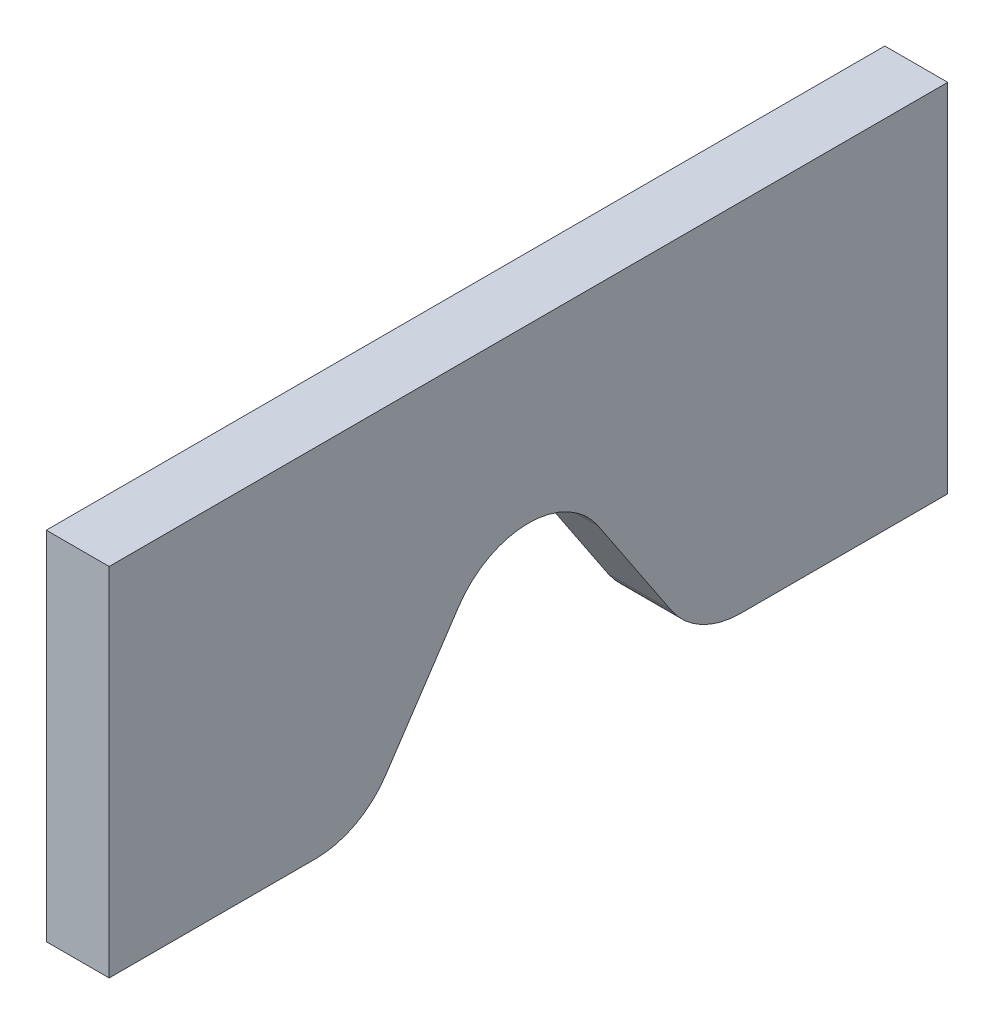
ISO-10303-21;
HEADER;
FILE_DESCRIPTION(('STEP AP214'),'2;1');
FILE_NAME('part.step','',(''),(''),'','','');
FILE_SCHEMA(('AUTOMOTIVE_DESIGN { 1 0 10303 214 1 1 1 1 }'));
ENDSEC;
DATA;
#1=APPLICATION_CONTEXT('core data for automotive mechanical design processes');
#2=APPLICATION_PROTOCOL_DEFINITION('international standard','automotive_design',2000,#1);
#3=PRODUCT_CONTEXT('',#1,'mechanical');
#4=PRODUCT('Part','Part','',(#3));
#5=PRODUCT_RELATED_PRODUCT_CATEGORY('part','',(#4));
#6=PRODUCT_DEFINITION_FORMATION('','',#4);
#7=PRODUCT_DEFINITION_CONTEXT('part definition',#1,'design');
#8=PRODUCT_DEFINITION('design','',#6,#7);
#9=PRODUCT_DEFINITION_SHAPE('','',#8);
#10=(LENGTH_UNIT() NAMED_UNIT(*) SI_UNIT(.MILLI.,.METRE.));
#11=(NAMED_UNIT(*) PLANE_ANGLE_UNIT() SI_UNIT($,.RADIAN.));
#12=(NAMED_UNIT(*) SI_UNIT($,.STERADIAN.) SOLID_ANGLE_UNIT());
#13=UNCERTAINTY_MEASURE_WITH_UNIT(LENGTH_MEASURE(1.E-05),#10,'distance_accuracy_value','');
#14=(GEOMETRIC_REPRESENTATION_CONTEXT(3) GLOBAL_UNCERTAINTY_ASSIGNED_CONTEXT((#13)) GLOBAL_UNIT_ASSIGNED_CONTEXT((#10,
#11,#12)) REPRESENTATION_CONTEXT('',''));
#15=CARTESIAN_POINT('',(0.,0.,0.));
#16=DIRECTION('',(0.,0.,1.));
#17=DIRECTION('',(1.,0.,0.));
#18=AXIS2_PLACEMENT_3D('',#15,#16,#17);
#19=CARTESIAN_POINT('',(19.05,0.,64.3936674655951));
#20=DIRECTION('',(0.,1.,0.));
#21=DIRECTION('',(0.,0.,1.));
#22=AXIS2_PLACEMENT_3D('',#19,#20,#21);
#23=PLANE('',#22);
#24=DIRECTION('',(0.,0.,-1.));
#25=VECTOR('',#24,1.);
#26=CARTESIAN_POINT('',(0.,0.,64.3936674655951));
#27=LINE('',#26,#25);
#28=CARTESIAN_POINT('',(0.,0.,127.));
#29=VERTEX_POINT('',#28);
#30=CARTESIAN_POINT('',(0.,0.,64.3936674655951));
#31=VERTEX_POINT('',#30);
#32=EDGE_CURVE('E141',#29,#31,#27,.T.);
#33=ORIENTED_EDGE('',*,*,#32,.T.);
#34=DIRECTION('',(-1.,0.,0.));
#35=VECTOR('',#34,1.);
#36=CARTESIAN_POINT('',(19.05,0.,64.3936674655951));
#37=LINE('',#36,#35);
#38=CARTESIAN_POINT('',(19.05,0.,64.3936674655951));
#39=VERTEX_POINT('',#38);
#40=EDGE_CURVE('E11',#39,#31,#37,.T.);
#41=ORIENTED_EDGE('',*,*,#40,.F.);
#42=DIRECTION('',(0.,0.,-1.));
#43=VECTOR('',#42,1.);
#44=CARTESIAN_POINT('',(19.05,0.,64.3936674655951));
#45=LINE('',#44,#43);
#46=CARTESIAN_POINT('',(19.05,0.,127.));
#47=VERTEX_POINT('',#46);
#48=EDGE_CURVE('E159',#47,#39,#45,.T.);
#49=ORIENTED_EDGE('',*,*,#48,.F.);
#50=DIRECTION('',(-1.,0.,0.));
#51=VECTOR('',#50,1.);
#52=CARTESIAN_POINT('',(19.05,0.,127.));
#53=LINE('',#52,#51);
#54=EDGE_CURVE('E137',#47,#29,#53,.T.);
#55=ORIENTED_EDGE('',*,*,#54,.T.);
#56=EDGE_LOOP('',(#33,#41,#49,#55));
#57=FACE_BOUND('',#56,.T.);
#58=ADVANCED_FACE('F33',(#57),#23,.F.);
#59=CARTESIAN_POINT('',(19.05,25.4,64.3936674655951));
#60=DIRECTION('',(-1.,0.,0.));
#61=DIRECTION('',(0.,0.,1.));
#62=AXIS2_PLACEMENT_3D('',#59,#60,#61);
#63=CYLINDRICAL_SURFACE('',#62,25.4);
#64=CARTESIAN_POINT('',(0.,25.4,64.3936674655951));
#65=DIRECTION('',(1.,0.,0.));
#66=DIRECTION('',(0.,0.,1.));
#67=AXIS2_PLACEMENT_3D('',#64,#65,#66);
#68=CIRCLE('',#67,25.4);
#69=CARTESIAN_POINT('',(0.,11.3106150158792,43.2595899894139));
#70=VERTEX_POINT('',#69);
#71=EDGE_CURVE('E144',#31,#70,#68,.T.);
#72=ORIENTED_EDGE('',*,*,#71,.T.);
#73=DIRECTION('',(-1.,0.,0.));
#74=VECTOR('',#73,1.);
#75=CARTESIAN_POINT('',(19.05,11.3106150158792,43.2595899894139));
#76=LINE('',#75,#74);
#77=CARTESIAN_POINT('',(19.05,11.3106150158792,43.2595899894139));
#78=VERTEX_POINT('',#77);
#79=EDGE_CURVE('E41',#78,#70,#76,.T.);
#80=ORIENTED_EDGE('',*,*,#79,.F.);
#81=CARTESIAN_POINT('',(19.05,25.4,64.3936674655951));
#82=DIRECTION('',(1.,0.,0.));
#83=DIRECTION('',(0.,0.,1.));
#84=AXIS2_PLACEMENT_3D('',#81,#82,#83);
#85=CIRCLE('',#84,25.4);
#86=EDGE_CURVE('E98',#39,#78,#85,.T.);
#87=ORIENTED_EDGE('',*,*,#86,.F.);
#88=ORIENTED_EDGE('',*,*,#40,.T.);
#89=EDGE_LOOP('',(#72,#80,#87,#88));
#90=FACE_BOUND('',#89,.T.);
#91=ADVANCED_FACE('F208',(#90),#63,.T.);
#92=CARTESIAN_POINT('',(19.05,44.4988837857281,21.1340774761812));
#93=DIRECTION('',(0.,0.554700196225229,0.832050294337844));
#94=DIRECTION('',(0.,-0.832050294337844,0.554700196225229));
#95=AXIS2_PLACEMENT_3D('',#92,#93,#94);
#96=PLANE('',#95);
#97=DIRECTION('',(0.,0.832050294337844,-0.554700196225229));
#98=VECTOR('',#97,1.);
#99=CARTESIAN_POINT('',(0.,44.4988837857281,21.1340774761812));
#100=LINE('',#99,#98);
#101=CARTESIAN_POINT('',(0.,44.4988837857281,21.1340774761812));
#102=VERTEX_POINT('',#101);
#103=EDGE_CURVE('E146',#70,#102,#100,.T.);
#104=ORIENTED_EDGE('',*,*,#103,.T.);
#105=DIRECTION('',(-1.,0.,0.));
#106=VECTOR('',#105,1.);
#107=CARTESIAN_POINT('',(19.05,44.4988837857281,21.1340774761812));
#108=LINE('',#107,#106);
#109=CARTESIAN_POINT('',(19.05,44.4988837857281,21.1340774761812));
#110=VERTEX_POINT('',#109);
#111=EDGE_CURVE('E172',#110,#102,#108,.T.);
#112=ORIENTED_EDGE('',*,*,#111,.F.);
#113=DIRECTION('',(0.,0.832050294337844,-0.554700196225229));
#114=VECTOR('',#113,1.);
#115=CARTESIAN_POINT('',(19.05,44.4988837857281,21.1340774761812));
#116=LINE('',#115,#114);
#117=EDGE_CURVE('E180',#78,#110,#116,.T.);
#118=ORIENTED_EDGE('',*,*,#117,.F.);
#119=ORIENTED_EDGE('',*,*,#79,.T.);
#120=EDGE_LOOP('',(#104,#112,#118,#119));
#121=FACE_BOUND('',#120,.T.);
#122=ADVANCED_FACE('F178',(#121),#96,.F.);
#123=CARTESIAN_POINT('',(19.05,30.4094988016073,0.));
#124=DIRECTION('',(-1.,0.,0.));
#125=DIRECTION('',(0.,0.,1.));
#126=AXIS2_PLACEMENT_3D('',#123,#124,#125);
#127=CYLINDRICAL_SURFACE('',#126,25.4);
#128=CARTESIAN_POINT('',(0.,30.4094988016073,0.));
#129=DIRECTION('',(-1.,0.,0.));
#130=DIRECTION('',(0.,0.,-1.));
#131=AXIS2_PLACEMENT_3D('',#128,#129,#130);
#132=CIRCLE('',#131,25.4);
#133=CARTESIAN_POINT('',(0.,44.4988837857281,-21.1340774761812));
#134=VERTEX_POINT('',#133);
#135=EDGE_CURVE('E148',#102,#134,#132,.T.);
#136=ORIENTED_EDGE('',*,*,#135,.T.);
#137=DIRECTION('',(-1.,0.,0.));
#138=VECTOR('',#137,1.);
#139=CARTESIAN_POINT('',(19.05,44.4988837857281,-21.1340774761812));
#140=LINE('',#139,#138);
#141=CARTESIAN_POINT('',(19.05,44.4988837857281,-21.1340774761812));
#142=VERTEX_POINT('',#141);
#143=EDGE_CURVE('E169',#142,#134,#140,.T.);
#144=ORIENTED_EDGE('',*,*,#143,.F.);
#145=CARTESIAN_POINT('',(19.05,30.4094988016073,0.));
#146=DIRECTION('',(-1.,0.,0.));
#147=DIRECTION('',(0.,0.,-1.));
#148=AXIS2_PLACEMENT_3D('',#145,#146,#147);
#149=CIRCLE('',#148,25.4);
#150=EDGE_CURVE('E198',#110,#142,#149,.T.);
#151=ORIENTED_EDGE('',*,*,#150,.F.);
#152=ORIENTED_EDGE('',*,*,#111,.T.);
#153=EDGE_LOOP('',(#136,#144,#151,#152));
#154=FACE_BOUND('',#153,.T.);
#155=ADVANCED_FACE('F189',(#154),#127,.F.);
#156=CARTESIAN_POINT('',(19.05,11.3106150158792,-43.2595899894139));
#157=DIRECTION('',(0.,0.554700196225229,-0.832050294337844));
#158=DIRECTION('',(0.,0.832050294337844,0.554700196225229));
#159=AXIS2_PLACEMENT_3D('',#156,#157,#158);
#160=PLANE('',#159);
#161=DIRECTION('',(0.,-0.832050294337844,-0.554700196225229));
#162=VECTOR('',#161,1.);
#163=CARTESIAN_POINT('',(0.,11.3106150158792,-43.2595899894139));
#164=LINE('',#163,#162);
#165=CARTESIAN_POINT('',(0.,11.3106150158792,-43.2595899894139));
#166=VERTEX_POINT('',#165);
#167=EDGE_CURVE('E150',#134,#166,#164,.T.);
#168=ORIENTED_EDGE('',*,*,#167,.T.);
#169=DIRECTION('',(-1.,0.,0.));
#170=VECTOR('',#169,1.);
#171=CARTESIAN_POINT('',(19.05,11.3106150158792,-43.2595899894139));
#172=LINE('',#171,#170);
#173=CARTESIAN_POINT('',(19.05,11.3106150158792,-43.2595899894139));
#174=VERTEX_POINT('',#173);
#175=EDGE_CURVE('E166',#174,#166,#172,.T.);
#176=ORIENTED_EDGE('',*,*,#175,.F.);
#177=DIRECTION('',(0.,-0.832050294337844,-0.554700196225229));
#178=VECTOR('',#177,1.);
#179=CARTESIAN_POINT('',(19.05,11.3106150158792,-43.2595899894139));
#180=LINE('',#179,#178);
#181=EDGE_CURVE('E195',#142,#174,#180,.T.);
#182=ORIENTED_EDGE('',*,*,#181,.F.);
#183=ORIENTED_EDGE('',*,*,#143,.T.);
#184=EDGE_LOOP('',(#168,#176,#182,#183));
#185=FACE_BOUND('',#184,.T.);
#186=ADVANCED_FACE('F193',(#185),#160,.F.);
#187=CARTESIAN_POINT('',(19.05,25.4,-64.3936674655951));
#188=DIRECTION('',(-1.,0.,0.));
#189=DIRECTION('',(0.,0.,1.));
#190=AXIS2_PLACEMENT_3D('',#187,#188,#189);
#191=CYLINDRICAL_SURFACE('',#190,25.4);
#192=CARTESIAN_POINT('',(0.,25.4,-64.3936674655951));
#193=DIRECTION('',(1.,0.,0.));
#194=DIRECTION('',(0.,0.,1.));
#195=AXIS2_PLACEMENT_3D('',#192,#193,#194);
#196=CIRCLE('',#195,25.4);
#197=CARTESIAN_POINT('',(0.,0.,-64.3936674655951));
#198=VERTEX_POINT('',#197);
#199=EDGE_CURVE('E152',#166,#198,#196,.T.);
#200=ORIENTED_EDGE('',*,*,#199,.T.);
#201=DIRECTION('',(-1.,0.,0.));
#202=VECTOR('',#201,1.);
#203=CARTESIAN_POINT('',(19.05,0.,-64.3936674655951));
#204=LINE('',#203,#202);
#205=CARTESIAN_POINT('',(19.05,0.,-64.3936674655951));
#206=VERTEX_POINT('',#205);
#207=EDGE_CURVE('E163',#206,#198,#204,.T.);
#208=ORIENTED_EDGE('',*,*,#207,.F.);
#209=CARTESIAN_POINT('',(19.05,25.4,-64.3936674655951));
#210=DIRECTION('',(1.,0.,0.));
#211=DIRECTION('',(0.,0.,1.));
#212=AXIS2_PLACEMENT_3D('',#209,#210,#211);
#213=CIRCLE('',#212,25.4);
#214=EDGE_CURVE('E197',#174,#206,#213,.T.);
#215=ORIENTED_EDGE('',*,*,#214,.F.);
#216=ORIENTED_EDGE('',*,*,#175,.T.);
#217=EDGE_LOOP('',(#200,#208,#215,#216));
#218=FACE_BOUND('',#217,.T.);
#219=ADVANCED_FACE('F220',(#218),#191,.T.);
#220=CARTESIAN_POINT('',(19.05,0.,-127.));
#221=DIRECTION('',(0.,1.,0.));
#222=DIRECTION('',(0.,0.,1.));
#223=AXIS2_PLACEMENT_3D('',#220,#221,#222);
#224=PLANE('',#223);
#225=DIRECTION('',(0.,0.,-1.));
#226=VECTOR('',#225,1.);
#227=CARTESIAN_POINT('',(0.,0.,-127.));
#228=LINE('',#227,#226);
#229=CARTESIAN_POINT('',(0.,0.,-127.));
#230=VERTEX_POINT('',#229);
#231=EDGE_CURVE('E154',#198,#230,#228,.T.);
#232=ORIENTED_EDGE('',*,*,#231,.T.);
#233=DIRECTION('',(-1.,0.,0.));
#234=VECTOR('',#233,1.);
#235=CARTESIAN_POINT('',(19.05,0.,-127.));
#236=LINE('',#235,#234);
#237=CARTESIAN_POINT('',(19.05,0.,-127.));
#238=VERTEX_POINT('',#237);
#239=EDGE_CURVE('E132',#238,#230,#236,.T.);
#240=ORIENTED_EDGE('',*,*,#239,.F.);
#241=DIRECTION('',(0.,0.,-1.));
#242=VECTOR('',#241,1.);
#243=CARTESIAN_POINT('',(19.05,0.,-127.));
#244=LINE('',#243,#242);
#245=EDGE_CURVE('E123',#206,#238,#244,.T.);
#246=ORIENTED_EDGE('',*,*,#245,.F.);
#247=ORIENTED_EDGE('',*,*,#207,.T.);
#248=EDGE_LOOP('',(#232,#240,#246,#247));
#249=FACE_BOUND('',#248,.T.);
#250=ADVANCED_FACE('F223',(#249),#224,.F.);
#251=CARTESIAN_POINT('',(19.05,107.95,-127.));
#252=DIRECTION('',(0.,0.,1.));
#253=DIRECTION('',(1.,0.,0.));
#254=AXIS2_PLACEMENT_3D('',#251,#252,#253);
#255=PLANE('',#254);
#256=DIRECTION('',(0.,1.,0.));
#257=VECTOR('',#256,1.);
#258=CARTESIAN_POINT('',(0.,107.95,-127.));
#259=LINE('',#258,#257);
#260=CARTESIAN_POINT('',(0.,107.95,-127.));
#261=VERTEX_POINT('',#260);
#262=EDGE_CURVE('E131',#230,#261,#259,.T.);
#263=ORIENTED_EDGE('',*,*,#262,.T.);
#264=DIRECTION('',(-1.,0.,0.));
#265=VECTOR('',#264,1.);
#266=CARTESIAN_POINT('',(19.05,107.95,-127.));
#267=LINE('',#266,#265);
#268=CARTESIAN_POINT('',(19.05,107.95,-127.));
#269=VERTEX_POINT('',#268);
#270=EDGE_CURVE('E128',#269,#261,#267,.T.);
#271=ORIENTED_EDGE('',*,*,#270,.F.);
#272=DIRECTION('',(0.,1.,0.));
#273=VECTOR('',#272,1.);
#274=CARTESIAN_POINT('',(19.05,107.95,-127.));
#275=LINE('',#274,#273);
#276=EDGE_CURVE('E117',#238,#269,#275,.T.);
#277=ORIENTED_EDGE('',*,*,#276,.F.);
#278=ORIENTED_EDGE('',*,*,#239,.T.);
#279=EDGE_LOOP('',(#263,#271,#277,#278));
#280=FACE_BOUND('',#279,.T.);
#281=ADVANCED_FACE('F129',(#280),#255,.F.);
#282=CARTESIAN_POINT('',(19.05,107.95,127.));
#283=DIRECTION('',(0.,-1.,0.));
#284=DIRECTION('',(0.,0.,-1.));
#285=AXIS2_PLACEMENT_3D('',#282,#283,#284);
#286=PLANE('',#285);
#287=DIRECTION('',(0.,0.,1.));
#288=VECTOR('',#287,1.);
#289=CARTESIAN_POINT('',(0.,107.95,127.));
#290=LINE('',#289,#288);
#291=CARTESIAN_POINT('',(0.,107.95,127.));
#292=VERTEX_POINT('',#291);
#293=EDGE_CURVE('E84',#261,#292,#290,.T.);
#294=ORIENTED_EDGE('',*,*,#293,.T.);
#295=DIRECTION('',(-1.,0.,0.));
#296=VECTOR('',#295,1.);
#297=CARTESIAN_POINT('',(19.05,107.95,127.));
#298=LINE('',#297,#296);
#299=CARTESIAN_POINT('',(19.05,107.95,127.));
#300=VERTEX_POINT('',#299);
#301=EDGE_CURVE('E133',#300,#292,#298,.T.);
#302=ORIENTED_EDGE('',*,*,#301,.F.);
#303=DIRECTION('',(0.,0.,1.));
#304=VECTOR('',#303,1.);
#305=CARTESIAN_POINT('',(19.05,107.95,127.));
#306=LINE('',#305,#304);
#307=EDGE_CURVE('E121',#269,#300,#306,.T.);
#308=ORIENTED_EDGE('',*,*,#307,.F.);
#309=ORIENTED_EDGE('',*,*,#270,.T.);
#310=EDGE_LOOP('',(#294,#302,#308,#309));
#311=FACE_BOUND('',#310,.T.);
#312=ADVANCED_FACE('F135',(#311),#286,.F.);
#313=CARTESIAN_POINT('',(19.05,0.,127.));
#314=DIRECTION('',(0.,0.,-1.));
#315=DIRECTION('',(-1.,0.,0.));
#316=AXIS2_PLACEMENT_3D('',#313,#314,#315);
#317=PLANE('',#316);
#318=DIRECTION('',(0.,-1.,0.));
#319=VECTOR('',#318,1.);
#320=CARTESIAN_POINT('',(0.,0.,127.));
#321=LINE('',#320,#319);
#322=EDGE_CURVE('E90',#292,#29,#321,.T.);
#323=ORIENTED_EDGE('',*,*,#322,.T.);
#324=ORIENTED_EDGE('',*,*,#54,.F.);
#325=DIRECTION('',(0.,-1.,0.));
#326=VECTOR('',#325,1.);
#327=CARTESIAN_POINT('',(19.05,0.,127.));
#328=LINE('',#327,#326);
#329=EDGE_CURVE('E49',#300,#47,#328,.T.);
#330=ORIENTED_EDGE('',*,*,#329,.F.);
#331=ORIENTED_EDGE('',*,*,#301,.T.);
#332=EDGE_LOOP('',(#323,#324,#330,#331));
#333=FACE_BOUND('',#332,.T.);
#334=ADVANCED_FACE('F232',(#333),#317,.F.);
#335=CARTESIAN_POINT('',(19.05,25.4,-64.3936674655951));
#336=DIRECTION('',(-1.,0.,0.));
#337=DIRECTION('',(0.,0.,1.));
#338=AXIS2_PLACEMENT_3D('',#335,#336,#337);
#339=PLANE('',#338);
#340=ORIENTED_EDGE('',*,*,#48,.T.);
#341=ORIENTED_EDGE('',*,*,#86,.T.);
#342=ORIENTED_EDGE('',*,*,#117,.T.);
#343=ORIENTED_EDGE('',*,*,#150,.T.);
#344=ORIENTED_EDGE('',*,*,#181,.T.);
#345=ORIENTED_EDGE('',*,*,#214,.T.);
#346=ORIENTED_EDGE('',*,*,#245,.T.);
#347=ORIENTED_EDGE('',*,*,#276,.T.);
#348=ORIENTED_EDGE('',*,*,#307,.T.);
#349=ORIENTED_EDGE('',*,*,#329,.T.);
#350=EDGE_LOOP('',(#340,#341,#342,#343,#344,#345,#346,#347,#348,#349));
#351=FACE_BOUND('',#350,.T.);
#352=ADVANCED_FACE('F119',(#351),#339,.F.);
#353=CARTESIAN_POINT('',(0.,25.4,-64.3936674655951));
#354=DIRECTION('',(-1.,0.,0.));
#355=DIRECTION('',(0.,0.,1.));
#356=AXIS2_PLACEMENT_3D('',#353,#354,#355);
#357=PLANE('',#356);
#358=ORIENTED_EDGE('',*,*,#32,.F.);
#359=ORIENTED_EDGE('',*,*,#322,.F.);
#360=ORIENTED_EDGE('',*,*,#293,.F.);
#361=ORIENTED_EDGE('',*,*,#262,.F.);
#362=ORIENTED_EDGE('',*,*,#231,.F.);
#363=ORIENTED_EDGE('',*,*,#199,.F.);
#364=ORIENTED_EDGE('',*,*,#167,.F.);
#365=ORIENTED_EDGE('',*,*,#135,.F.);
#366=ORIENTED_EDGE('',*,*,#103,.F.);
#367=ORIENTED_EDGE('',*,*,#71,.F.);
#368=EDGE_LOOP('',(#358,#359,#360,#361,#362,#363,#364,#365,#366,#367));
#369=FACE_BOUND('',#368,.T.);
#370=ADVANCED_FACE('F184',(#369),#357,.T.);
#371=CLOSED_SHELL('',(#58,#91,#122,#155,#186,#219,#250,#281,#312,#334,#352,#370));
#372=MANIFOLD_SOLID_BREP('B2',#371);
#373=ADVANCED_BREP_SHAPE_REPRESENTATION('',(#18,#372),#14);
#374=SHAPE_DEFINITION_REPRESENTATION(#9,#373);
ENDSEC;
END-ISO-10303-21;
